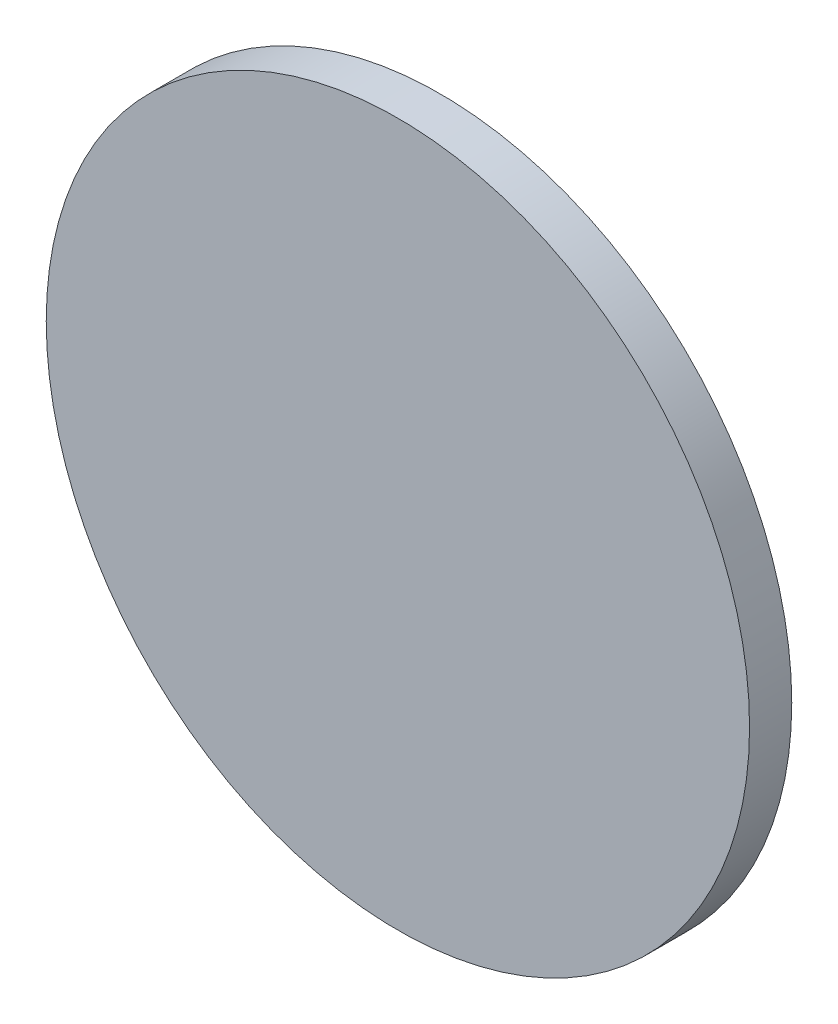
ISO-10303-21;
HEADER;
FILE_DESCRIPTION(('STEP AP214'),'2;1');
FILE_NAME('part.step','',(''),(''),'','','');
FILE_SCHEMA(('AUTOMOTIVE_DESIGN { 1 0 10303 214 1 1 1 1 }'));
ENDSEC;
DATA;
#1=APPLICATION_CONTEXT('core data for automotive mechanical design processes');
#2=APPLICATION_PROTOCOL_DEFINITION('international standard','automotive_design',2000,#1);
#3=PRODUCT_CONTEXT('',#1,'mechanical');
#4=PRODUCT('Part','Part','',(#3));
#5=PRODUCT_RELATED_PRODUCT_CATEGORY('part','',(#4));
#6=PRODUCT_DEFINITION_FORMATION('','',#4);
#7=PRODUCT_DEFINITION_CONTEXT('part definition',#1,'design');
#8=PRODUCT_DEFINITION('design','',#6,#7);
#9=PRODUCT_DEFINITION_SHAPE('','',#8);
#10=(LENGTH_UNIT() NAMED_UNIT(*) SI_UNIT(.MILLI.,.METRE.));
#11=(NAMED_UNIT(*) PLANE_ANGLE_UNIT() SI_UNIT($,.RADIAN.));
#12=(NAMED_UNIT(*) SI_UNIT($,.STERADIAN.) SOLID_ANGLE_UNIT());
#13=UNCERTAINTY_MEASURE_WITH_UNIT(LENGTH_MEASURE(1.E-05),#10,'distance_accuracy_value','');
#14=(GEOMETRIC_REPRESENTATION_CONTEXT(3) GLOBAL_UNCERTAINTY_ASSIGNED_CONTEXT((#13)) GLOBAL_UNIT_ASSIGNED_CONTEXT((#10,
#11,#12)) REPRESENTATION_CONTEXT('',''));
#15=CARTESIAN_POINT('',(0.,0.,0.));
#16=DIRECTION('',(0.,0.,1.));
#17=DIRECTION('',(1.,0.,0.));
#18=AXIS2_PLACEMENT_3D('',#15,#16,#17);
#19=CARTESIAN_POINT('',(0.,0.,3.));
#20=DIRECTION('',(0.,0.,-1.));
#21=DIRECTION('',(-1.,0.,0.));
#22=AXIS2_PLACEMENT_3D('',#19,#20,#21);
#23=CYLINDRICAL_SURFACE('',#22,25.);
#24=CARTESIAN_POINT('',(0.,0.,3.));
#25=DIRECTION('',(0.,0.,1.));
#26=DIRECTION('',(1.,0.,0.));
#27=AXIS2_PLACEMENT_3D('',#24,#25,#26);
#28=CIRCLE('',#27,25.);
#29=CARTESIAN_POINT('',(25.,0.,3.));
#30=VERTEX_POINT('',#29);
#31=EDGE_CURVE('E10',#30,#30,#28,.T.);
#32=ORIENTED_EDGE('',*,*,#31,.F.);
#33=EDGE_LOOP('',(#32));
#34=FACE_BOUND('',#33,.T.);
#35=CARTESIAN_POINT('',(0.,0.,0.));
#36=DIRECTION('',(0.,0.,1.));
#37=DIRECTION('',(1.,0.,0.));
#38=AXIS2_PLACEMENT_3D('',#35,#36,#37);
#39=CIRCLE('',#38,25.);
#40=CARTESIAN_POINT('',(25.,0.,0.));
#41=VERTEX_POINT('',#40);
#42=EDGE_CURVE('E34',#41,#41,#39,.T.);
#43=ORIENTED_EDGE('',*,*,#42,.T.);
#44=EDGE_LOOP('',(#43));
#45=FACE_BOUND('',#44,.T.);
#46=ADVANCED_FACE('F31',(#34,#45),#23,.T.);
#47=CARTESIAN_POINT('',(0.,0.,3.));
#48=DIRECTION('',(0.,0.,1.));
#49=DIRECTION('',(1.,0.,0.));
#50=AXIS2_PLACEMENT_3D('',#47,#48,#49);
#51=PLANE('',#50);
#52=ORIENTED_EDGE('',*,*,#31,.T.);
#53=EDGE_LOOP('',(#52));
#54=FACE_BOUND('',#53,.T.);
#55=ADVANCED_FACE('F46',(#54),#51,.T.);
#56=CARTESIAN_POINT('',(0.,0.,0.));
#57=DIRECTION('',(0.,0.,1.));
#58=DIRECTION('',(1.,0.,0.));
#59=AXIS2_PLACEMENT_3D('',#56,#57,#58);
#60=PLANE('',#59);
#61=ORIENTED_EDGE('',*,*,#42,.F.);
#62=EDGE_LOOP('',(#61));
#63=FACE_BOUND('',#62,.T.);
#64=ADVANCED_FACE('F44',(#63),#60,.F.);
#65=CLOSED_SHELL('',(#46,#55,#64));
#66=MANIFOLD_SOLID_BREP('B2',#65);
#67=ADVANCED_BREP_SHAPE_REPRESENTATION('',(#18,#66),#14);
#68=SHAPE_DEFINITION_REPRESENTATION(#9,#67);
ENDSEC;
END-ISO-10303-21;
